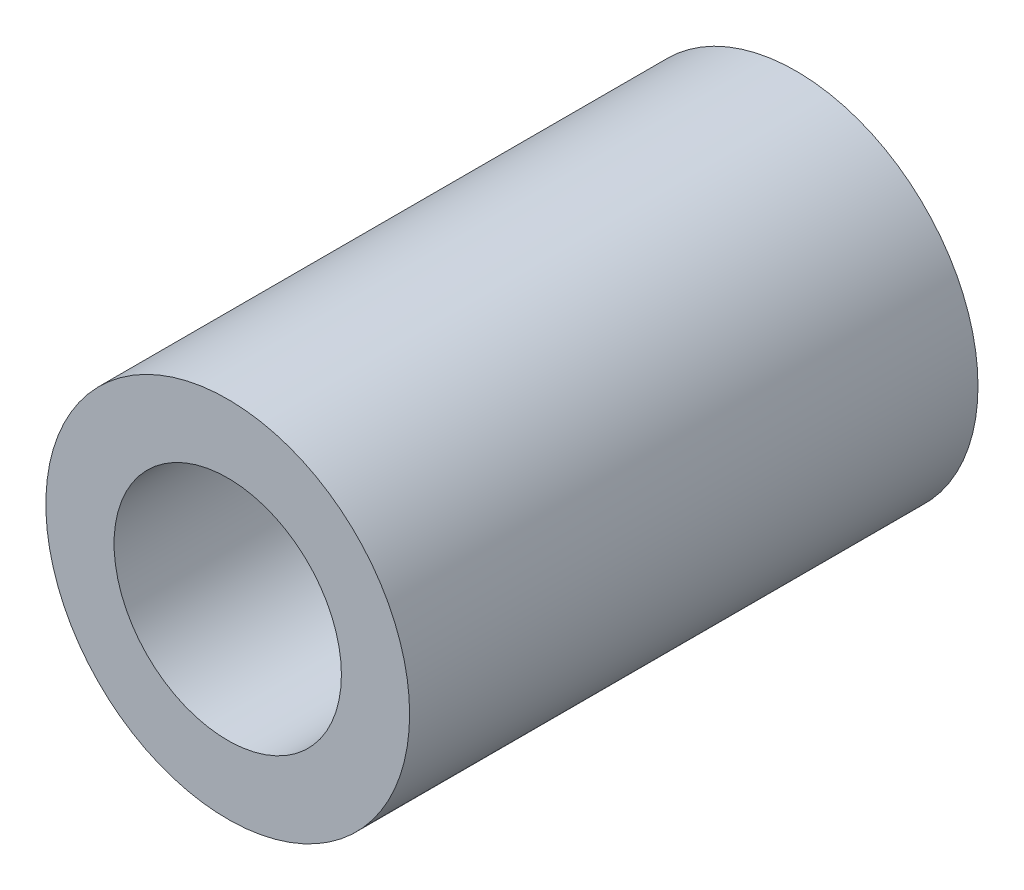
ISO-10303-21;
HEADER;
FILE_DESCRIPTION(('STEP AP214'),'2;1');
FILE_NAME('part.step','',(''),(''),'','','');
FILE_SCHEMA(('AUTOMOTIVE_DESIGN { 1 0 10303 214 1 1 1 1 }'));
ENDSEC;
DATA;
#1=APPLICATION_CONTEXT('core data for automotive mechanical design processes');
#2=APPLICATION_PROTOCOL_DEFINITION('international standard','automotive_design',2000,#1);
#3=PRODUCT_CONTEXT('',#1,'mechanical');
#4=PRODUCT('Part','Part','',(#3));
#5=PRODUCT_RELATED_PRODUCT_CATEGORY('part','',(#4));
#6=PRODUCT_DEFINITION_FORMATION('','',#4);
#7=PRODUCT_DEFINITION_CONTEXT('part definition',#1,'design');
#8=PRODUCT_DEFINITION('design','',#6,#7);
#9=PRODUCT_DEFINITION_SHAPE('','',#8);
#10=(LENGTH_UNIT() NAMED_UNIT(*) SI_UNIT(.MILLI.,.METRE.));
#11=(NAMED_UNIT(*) PLANE_ANGLE_UNIT() SI_UNIT($,.RADIAN.));
#12=(NAMED_UNIT(*) SI_UNIT($,.STERADIAN.) SOLID_ANGLE_UNIT());
#13=UNCERTAINTY_MEASURE_WITH_UNIT(LENGTH_MEASURE(1.E-05),#10,'distance_accuracy_value','');
#14=(GEOMETRIC_REPRESENTATION_CONTEXT(3) GLOBAL_UNCERTAINTY_ASSIGNED_CONTEXT((#13)) GLOBAL_UNIT_ASSIGNED_CONTEXT((#10,
#11,#12)) REPRESENTATION_CONTEXT('',''));
#15=CARTESIAN_POINT('',(0.,0.,0.));
#16=DIRECTION('',(0.,0.,1.));
#17=DIRECTION('',(1.,0.,0.));
#18=AXIS2_PLACEMENT_3D('',#15,#16,#17);
#19=CARTESIAN_POINT('',(84.25,0.,25.));
#20=DIRECTION('',(0.,0.,1.));
#21=DIRECTION('',(1.,0.,0.));
#22=AXIS2_PLACEMENT_3D('',#19,#20,#21);
#23=PLANE('',#22);
#24=CARTESIAN_POINT('',(84.25,0.,25.));
#25=DIRECTION('',(0.,0.,1.));
#26=DIRECTION('',(1.,0.,0.));
#27=AXIS2_PLACEMENT_3D('',#24,#25,#26);
#28=CIRCLE('',#27,8.);
#29=CARTESIAN_POINT('',(92.25,0.,25.));
#30=VERTEX_POINT('',#29);
#31=EDGE_CURVE('E10',#30,#30,#28,.T.);
#32=ORIENTED_EDGE('',*,*,#31,.T.);
#33=EDGE_LOOP('',(#32));
#34=FACE_BOUND('',#33,.T.);
#35=CARTESIAN_POINT('',(84.25,0.,25.));
#36=DIRECTION('',(0.,0.,1.));
#37=DIRECTION('',(1.,0.,0.));
#38=AXIS2_PLACEMENT_3D('',#35,#36,#37);
#39=CIRCLE('',#38,5.);
#40=CARTESIAN_POINT('',(89.25,0.,25.));
#41=VERTEX_POINT('',#40);
#42=EDGE_CURVE('E42',#41,#41,#39,.T.);
#43=ORIENTED_EDGE('',*,*,#42,.F.);
#44=EDGE_LOOP('',(#43));
#45=FACE_BOUND('',#44,.T.);
#46=ADVANCED_FACE('F31',(#34,#45),#23,.T.);
#47=CARTESIAN_POINT('',(84.25,0.,0.));
#48=DIRECTION('',(0.,0.,1.));
#49=DIRECTION('',(1.,0.,0.));
#50=AXIS2_PLACEMENT_3D('',#47,#48,#49);
#51=PLANE('',#50);
#52=CARTESIAN_POINT('',(84.25,0.,0.));
#53=DIRECTION('',(0.,0.,1.));
#54=DIRECTION('',(1.,0.,0.));
#55=AXIS2_PLACEMENT_3D('',#52,#53,#54);
#56=CIRCLE('',#55,8.);
#57=CARTESIAN_POINT('',(92.25,0.,0.));
#58=VERTEX_POINT('',#57);
#59=EDGE_CURVE('E35',#58,#58,#56,.T.);
#60=ORIENTED_EDGE('',*,*,#59,.F.);
#61=EDGE_LOOP('',(#60));
#62=FACE_BOUND('',#61,.T.);
#63=CARTESIAN_POINT('',(84.25,0.,0.));
#64=DIRECTION('',(0.,0.,1.));
#65=DIRECTION('',(1.,0.,0.));
#66=AXIS2_PLACEMENT_3D('',#63,#64,#65);
#67=CIRCLE('',#66,5.);
#68=CARTESIAN_POINT('',(89.25,0.,0.));
#69=VERTEX_POINT('',#68);
#70=EDGE_CURVE('E44',#69,#69,#67,.T.);
#71=ORIENTED_EDGE('',*,*,#70,.T.);
#72=EDGE_LOOP('',(#71));
#73=FACE_BOUND('',#72,.T.);
#74=ADVANCED_FACE('F54',(#62,#73),#51,.F.);
#75=CARTESIAN_POINT('',(84.25,0.,25.));
#76=DIRECTION('',(0.,0.,-1.));
#77=DIRECTION('',(-1.,0.,0.));
#78=AXIS2_PLACEMENT_3D('',#75,#76,#77);
#79=CYLINDRICAL_SURFACE('',#78,8.);
#80=ORIENTED_EDGE('',*,*,#31,.F.);
#81=EDGE_LOOP('',(#80));
#82=FACE_BOUND('',#81,.T.);
#83=ORIENTED_EDGE('',*,*,#59,.T.);
#84=EDGE_LOOP('',(#83));
#85=FACE_BOUND('',#84,.T.);
#86=ADVANCED_FACE('F33',(#82,#85),#79,.T.);
#87=CARTESIAN_POINT('',(84.25,0.,25.));
#88=DIRECTION('',(0.,0.,-1.));
#89=DIRECTION('',(-1.,0.,0.));
#90=AXIS2_PLACEMENT_3D('',#87,#88,#89);
#91=CYLINDRICAL_SURFACE('',#90,5.);
#92=ORIENTED_EDGE('',*,*,#42,.T.);
#93=EDGE_LOOP('',(#92));
#94=FACE_BOUND('',#93,.T.);
#95=ORIENTED_EDGE('',*,*,#70,.F.);
#96=EDGE_LOOP('',(#95));
#97=FACE_BOUND('',#96,.T.);
#98=ADVANCED_FACE('F50',(#94,#97),#91,.F.);
#99=CLOSED_SHELL('',(#46,#74,#86,#98));
#100=MANIFOLD_SOLID_BREP('B2',#99);
#101=ADVANCED_BREP_SHAPE_REPRESENTATION('',(#18,#100),#14);
#102=SHAPE_DEFINITION_REPRESENTATION(#9,#101);
ENDSEC;
END-ISO-10303-21;
